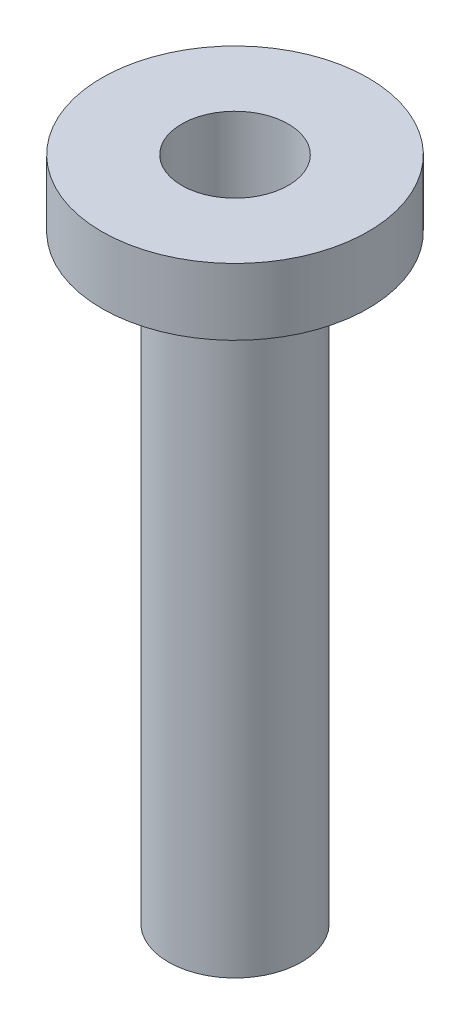
ISO-10303-21;
HEADER;
FILE_DESCRIPTION(('STEP AP214'),'2;1');
FILE_NAME('part.step','',(''),(''),'','','');
FILE_SCHEMA(('AUTOMOTIVE_DESIGN { 1 0 10303 214 1 1 1 1 }'));
ENDSEC;
DATA;
#1=APPLICATION_CONTEXT('core data for automotive mechanical design processes');
#2=APPLICATION_PROTOCOL_DEFINITION('international standard','automotive_design',2000,#1);
#3=PRODUCT_CONTEXT('',#1,'mechanical');
#4=PRODUCT('Part','Part','',(#3));
#5=PRODUCT_RELATED_PRODUCT_CATEGORY('part','',(#4));
#6=PRODUCT_DEFINITION_FORMATION('','',#4);
#7=PRODUCT_DEFINITION_CONTEXT('part definition',#1,'design');
#8=PRODUCT_DEFINITION('design','',#6,#7);
#9=PRODUCT_DEFINITION_SHAPE('','',#8);
#10=(LENGTH_UNIT() NAMED_UNIT(*) SI_UNIT(.MILLI.,.METRE.));
#11=(NAMED_UNIT(*) PLANE_ANGLE_UNIT() SI_UNIT($,.RADIAN.));
#12=(NAMED_UNIT(*) SI_UNIT($,.STERADIAN.) SOLID_ANGLE_UNIT());
#13=UNCERTAINTY_MEASURE_WITH_UNIT(LENGTH_MEASURE(1.E-05),#10,'distance_accuracy_value','');
#14=(GEOMETRIC_REPRESENTATION_CONTEXT(3) GLOBAL_UNCERTAINTY_ASSIGNED_CONTEXT((#13)) GLOBAL_UNIT_ASSIGNED_CONTEXT((#10,
#11,#12)) REPRESENTATION_CONTEXT('',''));
#15=CARTESIAN_POINT('',(0.,0.,0.));
#16=DIRECTION('',(0.,0.,1.));
#17=DIRECTION('',(1.,0.,0.));
#18=AXIS2_PLACEMENT_3D('',#15,#16,#17);
#19=CARTESIAN_POINT('',(0.,0.,0.));
#20=DIRECTION('',(0.,1.,0.));
#21=DIRECTION('',(0.,0.,1.));
#22=AXIS2_PLACEMENT_3D('',#19,#20,#21);
#23=CYLINDRICAL_SURFACE('',#22,12.7);
#24=CARTESIAN_POINT('',(0.,-6.35,0.));
#25=DIRECTION('',(0.,1.,0.));
#26=DIRECTION('',(0.,0.,1.));
#27=AXIS2_PLACEMENT_3D('',#24,#25,#26);
#28=CIRCLE('',#27,12.7);
#29=CARTESIAN_POINT('',(0.,-6.35,12.7));
#30=VERTEX_POINT('',#29);
#31=EDGE_CURVE('E10',#30,#30,#28,.T.);
#32=ORIENTED_EDGE('',*,*,#31,.T.);
#33=EDGE_LOOP('',(#32));
#34=FACE_BOUND('',#33,.T.);
#35=CARTESIAN_POINT('',(0.,0.,0.));
#36=DIRECTION('',(0.,1.,0.));
#37=DIRECTION('',(0.,0.,1.));
#38=AXIS2_PLACEMENT_3D('',#35,#36,#37);
#39=CIRCLE('',#38,12.7);
#40=CARTESIAN_POINT('',(0.,0.,12.7));
#41=VERTEX_POINT('',#40);
#42=EDGE_CURVE('E80',#41,#41,#39,.T.);
#43=ORIENTED_EDGE('',*,*,#42,.F.);
#44=EDGE_LOOP('',(#43));
#45=FACE_BOUND('',#44,.T.);
#46=ADVANCED_FACE('F37',(#34,#45),#23,.T.);
#47=CARTESIAN_POINT('',(-12.7,-6.35,0.));
#48=DIRECTION('',(0.,-1.,0.));
#49=DIRECTION('',(0.,0.,-1.));
#50=AXIS2_PLACEMENT_3D('',#47,#48,#49);
#51=PLANE('',#50);
#52=CARTESIAN_POINT('',(0.,-6.35,0.));
#53=DIRECTION('',(0.,1.,0.));
#54=DIRECTION('',(0.,0.,1.));
#55=AXIS2_PLACEMENT_3D('',#52,#53,#54);
#56=CIRCLE('',#55,11.1125);
#57=CARTESIAN_POINT('',(0.,-6.35,11.1125));
#58=VERTEX_POINT('',#57);
#59=EDGE_CURVE('E44',#58,#58,#56,.T.);
#60=ORIENTED_EDGE('',*,*,#59,.T.);
#61=EDGE_LOOP('',(#60));
#62=FACE_BOUND('',#61,.T.);
#63=ORIENTED_EDGE('',*,*,#31,.F.);
#64=EDGE_LOOP('',(#63));
#65=FACE_BOUND('',#64,.T.);
#66=ADVANCED_FACE('F89',(#62,#65),#51,.T.);
#67=CARTESIAN_POINT('',(0.,0.,0.));
#68=DIRECTION('',(0.,1.,0.));
#69=DIRECTION('',(0.,0.,1.));
#70=AXIS2_PLACEMENT_3D('',#67,#68,#69);
#71=CYLINDRICAL_SURFACE('',#70,11.1125);
#72=CARTESIAN_POINT('',(0.,-4.318,0.));
#73=DIRECTION('',(0.,1.,0.));
#74=DIRECTION('',(0.,0.,1.));
#75=AXIS2_PLACEMENT_3D('',#72,#73,#74);
#76=CIRCLE('',#75,11.1125);
#77=CARTESIAN_POINT('',(0.,-4.318,11.1125));
#78=VERTEX_POINT('',#77);
#79=EDGE_CURVE('E49',#78,#78,#76,.T.);
#80=ORIENTED_EDGE('',*,*,#79,.T.);
#81=EDGE_LOOP('',(#80));
#82=FACE_BOUND('',#81,.T.);
#83=ORIENTED_EDGE('',*,*,#59,.F.);
#84=EDGE_LOOP('',(#83));
#85=FACE_BOUND('',#84,.T.);
#86=ADVANCED_FACE('F93',(#82,#85),#71,.F.);
#87=CARTESIAN_POINT('',(-11.1125,-4.318,0.));
#88=DIRECTION('',(0.,-1.,0.));
#89=DIRECTION('',(0.,0.,-1.));
#90=AXIS2_PLACEMENT_3D('',#87,#88,#89);
#91=PLANE('',#90);
#92=CARTESIAN_POINT('',(0.,-4.318,0.));
#93=DIRECTION('',(0.,1.,0.));
#94=DIRECTION('',(0.,0.,1.));
#95=AXIS2_PLACEMENT_3D('',#92,#93,#94);
#96=CIRCLE('',#95,8.0645);
#97=CARTESIAN_POINT('',(0.,-4.318,8.0645));
#98=VERTEX_POINT('',#97);
#99=EDGE_CURVE('E54',#98,#98,#96,.T.);
#100=ORIENTED_EDGE('',*,*,#99,.T.);
#101=EDGE_LOOP('',(#100));
#102=FACE_BOUND('',#101,.T.);
#103=ORIENTED_EDGE('',*,*,#79,.F.);
#104=EDGE_LOOP('',(#103));
#105=FACE_BOUND('',#104,.T.);
#106=ADVANCED_FACE('F97',(#102,#105),#91,.T.);
#107=CARTESIAN_POINT('',(0.,0.,0.));
#108=DIRECTION('',(0.,1.,0.));
#109=DIRECTION('',(0.,0.,1.));
#110=AXIS2_PLACEMENT_3D('',#107,#108,#109);
#111=CYLINDRICAL_SURFACE('',#110,8.0645);
#112=CARTESIAN_POINT('',(0.,-6.35,0.));
#113=DIRECTION('',(0.,1.,0.));
#114=DIRECTION('',(0.,0.,1.));
#115=AXIS2_PLACEMENT_3D('',#112,#113,#114);
#116=CIRCLE('',#115,8.0645);
#117=CARTESIAN_POINT('',(0.,-6.35,8.0645));
#118=VERTEX_POINT('',#117);
#119=EDGE_CURVE('E60',#118,#118,#116,.T.);
#120=ORIENTED_EDGE('',*,*,#119,.T.);
#121=EDGE_LOOP('',(#120));
#122=FACE_BOUND('',#121,.T.);
#123=ORIENTED_EDGE('',*,*,#99,.F.);
#124=EDGE_LOOP('',(#123));
#125=FACE_BOUND('',#124,.T.);
#126=ADVANCED_FACE('F104',(#122,#125),#111,.T.);
#127=CARTESIAN_POINT('',(-8.0645,-6.35,0.));
#128=DIRECTION('',(0.,-1.,0.));
#129=DIRECTION('',(0.,0.,-1.));
#130=AXIS2_PLACEMENT_3D('',#127,#128,#129);
#131=PLANE('',#130);
#132=CARTESIAN_POINT('',(0.,-6.35,0.));
#133=DIRECTION('',(0.,1.,0.));
#134=DIRECTION('',(0.,0.,1.));
#135=AXIS2_PLACEMENT_3D('',#132,#133,#134);
#136=CIRCLE('',#135,6.35);
#137=CARTESIAN_POINT('',(0.,-6.35,6.35));
#138=VERTEX_POINT('',#137);
#139=EDGE_CURVE('E64',#138,#138,#136,.T.);
#140=ORIENTED_EDGE('',*,*,#139,.T.);
#141=EDGE_LOOP('',(#140));
#142=FACE_BOUND('',#141,.T.);
#143=ORIENTED_EDGE('',*,*,#119,.F.);
#144=EDGE_LOOP('',(#143));
#145=FACE_BOUND('',#144,.T.);
#146=ADVANCED_FACE('F108',(#142,#145),#131,.T.);
#147=CARTESIAN_POINT('',(0.,0.,0.));
#148=DIRECTION('',(0.,1.,0.));
#149=DIRECTION('',(0.,0.,1.));
#150=AXIS2_PLACEMENT_3D('',#147,#148,#149);
#151=CYLINDRICAL_SURFACE('',#150,6.35);
#152=CARTESIAN_POINT('',(0.,-63.5,0.));
#153=DIRECTION('',(0.,1.,0.));
#154=DIRECTION('',(0.,0.,1.));
#155=AXIS2_PLACEMENT_3D('',#152,#153,#154);
#156=CIRCLE('',#155,6.34999999999999);
#157=CARTESIAN_POINT('',(0.,-63.5,6.34999999999999));
#158=VERTEX_POINT('',#157);
#159=EDGE_CURVE('E68',#158,#158,#156,.T.);
#160=ORIENTED_EDGE('',*,*,#159,.T.);
#161=EDGE_LOOP('',(#160));
#162=FACE_BOUND('',#161,.T.);
#163=ORIENTED_EDGE('',*,*,#139,.F.);
#164=EDGE_LOOP('',(#163));
#165=FACE_BOUND('',#164,.T.);
#166=ADVANCED_FACE('F112',(#162,#165),#151,.T.);
#167=CARTESIAN_POINT('',(0.,-63.5,0.));
#168=DIRECTION('',(0.,-1.,0.));
#169=DIRECTION('',(0.,0.,-1.));
#170=AXIS2_PLACEMENT_3D('',#167,#168,#169);
#171=CONICAL_SURFACE('',#170,6.34999999999999,0.785398163397442);
#172=CARTESIAN_POINT('',(0.,-62.23,0.));
#173=DIRECTION('',(0.,1.,0.));
#174=DIRECTION('',(0.,0.,1.));
#175=AXIS2_PLACEMENT_3D('',#172,#173,#174);
#176=CIRCLE('',#175,5.08);
#177=CARTESIAN_POINT('',(0.,-62.23,5.08));
#178=VERTEX_POINT('',#177);
#179=EDGE_CURVE('E72',#178,#178,#176,.T.);
#180=ORIENTED_EDGE('',*,*,#179,.T.);
#181=EDGE_LOOP('',(#180));
#182=FACE_BOUND('',#181,.T.);
#183=ORIENTED_EDGE('',*,*,#159,.F.);
#184=EDGE_LOOP('',(#183));
#185=FACE_BOUND('',#184,.T.);
#186=ADVANCED_FACE('F116',(#182,#185),#171,.F.);
#187=CARTESIAN_POINT('',(0.,0.,0.));
#188=DIRECTION('',(0.,1.,0.));
#189=DIRECTION('',(0.,0.,1.));
#190=AXIS2_PLACEMENT_3D('',#187,#188,#189);
#191=CYLINDRICAL_SURFACE('',#190,5.08);
#192=CARTESIAN_POINT('',(0.,0.,0.));
#193=DIRECTION('',(0.,1.,0.));
#194=DIRECTION('',(0.,0.,1.));
#195=AXIS2_PLACEMENT_3D('',#192,#193,#194);
#196=CIRCLE('',#195,5.08);
#197=CARTESIAN_POINT('',(0.,0.,5.08));
#198=VERTEX_POINT('',#197);
#199=EDGE_CURVE('E76',#198,#198,#196,.T.);
#200=ORIENTED_EDGE('',*,*,#199,.T.);
#201=EDGE_LOOP('',(#200));
#202=FACE_BOUND('',#201,.T.);
#203=ORIENTED_EDGE('',*,*,#179,.F.);
#204=EDGE_LOOP('',(#203));
#205=FACE_BOUND('',#204,.T.);
#206=ADVANCED_FACE('F120',(#202,#205),#191,.F.);
#207=CARTESIAN_POINT('',(-5.08,0.,0.));
#208=DIRECTION('',(0.,1.,0.));
#209=DIRECTION('',(0.,0.,1.));
#210=AXIS2_PLACEMENT_3D('',#207,#208,#209);
#211=PLANE('',#210);
#212=ORIENTED_EDGE('',*,*,#42,.T.);
#213=EDGE_LOOP('',(#212));
#214=FACE_BOUND('',#213,.T.);
#215=ORIENTED_EDGE('',*,*,#199,.F.);
#216=EDGE_LOOP('',(#215));
#217=FACE_BOUND('',#216,.T.);
#218=ADVANCED_FACE('F85',(#214,#217),#211,.T.);
#219=CLOSED_SHELL('',(#46,#66,#86,#106,#126,#146,#166,#186,#206,#218));
#220=MANIFOLD_SOLID_BREP('B2',#219);
#221=ADVANCED_BREP_SHAPE_REPRESENTATION('',(#18,#220),#14);
#222=SHAPE_DEFINITION_REPRESENTATION(#9,#221);
ENDSEC;
END-ISO-10303-21;
